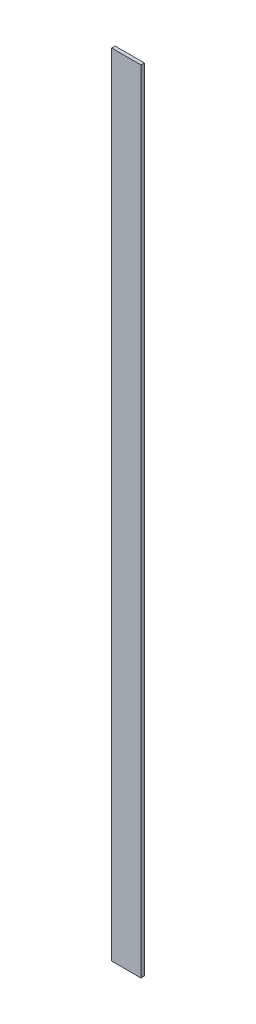
ISO-10303-21;
HEADER;
FILE_DESCRIPTION(('STEP AP214'),'2;1');
FILE_NAME('part.step','',(''),(''),'','','');
FILE_SCHEMA(('AUTOMOTIVE_DESIGN { 1 0 10303 214 1 1 1 1 }'));
ENDSEC;
DATA;
#1=APPLICATION_CONTEXT('core data for automotive mechanical design processes');
#2=APPLICATION_PROTOCOL_DEFINITION('international standard','automotive_design',2000,#1);
#3=PRODUCT_CONTEXT('',#1,'mechanical');
#4=PRODUCT('Part','Part','',(#3));
#5=PRODUCT_RELATED_PRODUCT_CATEGORY('part','',(#4));
#6=PRODUCT_DEFINITION_FORMATION('','',#4);
#7=PRODUCT_DEFINITION_CONTEXT('part definition',#1,'design');
#8=PRODUCT_DEFINITION('design','',#6,#7);
#9=PRODUCT_DEFINITION_SHAPE('','',#8);
#10=(LENGTH_UNIT() NAMED_UNIT(*) SI_UNIT(.MILLI.,.METRE.));
#11=(NAMED_UNIT(*) PLANE_ANGLE_UNIT() SI_UNIT($,.RADIAN.));
#12=(NAMED_UNIT(*) SI_UNIT($,.STERADIAN.) SOLID_ANGLE_UNIT());
#13=UNCERTAINTY_MEASURE_WITH_UNIT(LENGTH_MEASURE(1.E-05),#10,'distance_accuracy_value','');
#14=(GEOMETRIC_REPRESENTATION_CONTEXT(3) GLOBAL_UNCERTAINTY_ASSIGNED_CONTEXT((#13)) GLOBAL_UNIT_ASSIGNED_CONTEXT((#10,
#11,#12)) REPRESENTATION_CONTEXT('',''));
#15=CARTESIAN_POINT('',(0.,0.,0.));
#16=DIRECTION('',(0.,0.,1.));
#17=DIRECTION('',(1.,0.,0.));
#18=AXIS2_PLACEMENT_3D('',#15,#16,#17);
#19=CARTESIAN_POINT('',(-3.79611650485437,15.8033980582524,-1.));
#20=DIRECTION('',(-1.,0.,0.));
#21=DIRECTION('',(0.,-1.,0.));
#22=AXIS2_PLACEMENT_3D('',#19,#20,#21);
#23=PLANE('',#22);
#24=DIRECTION('',(0.,-1.,0.));
#25=VECTOR('',#24,1.);
#26=CARTESIAN_POINT('',(-3.79611650485437,15.8033980582524,0.));
#27=LINE('',#26,#25);
#28=CARTESIAN_POINT('',(-3.79611650485437,15.8033980582524,0.));
#29=VERTEX_POINT('',#28);
#30=CARTESIAN_POINT('',(-3.79611650485434,-214.196601941748,0.));
#31=VERTEX_POINT('',#30);
#32=EDGE_CURVE('E100',#29,#31,#27,.T.);
#33=ORIENTED_EDGE('',*,*,#32,.F.);
#34=DIRECTION('',(0.,0.,1.));
#35=VECTOR('',#34,1.);
#36=CARTESIAN_POINT('',(-3.79611650485437,15.8033980582524,-1.));
#37=LINE('',#36,#35);
#38=CARTESIAN_POINT('',(-3.79611650485437,15.8033980582524,-1.));
#39=VERTEX_POINT('',#38);
#40=EDGE_CURVE('E11',#39,#29,#37,.T.);
#41=ORIENTED_EDGE('',*,*,#40,.F.);
#42=DIRECTION('',(0.,-1.,0.));
#43=VECTOR('',#42,1.);
#44=CARTESIAN_POINT('',(-3.79611650485437,15.8033980582524,-1.));
#45=LINE('',#44,#43);
#46=CARTESIAN_POINT('',(-3.79611650485434,-214.196601941748,-1.));
#47=VERTEX_POINT('',#46);
#48=EDGE_CURVE('E94',#39,#47,#45,.T.);
#49=ORIENTED_EDGE('',*,*,#48,.T.);
#50=DIRECTION('',(0.,0.,1.));
#51=VECTOR('',#50,1.);
#52=CARTESIAN_POINT('',(-3.79611650485434,-214.196601941748,-1.));
#53=LINE('',#52,#51);
#54=EDGE_CURVE('E39',#47,#31,#53,.T.);
#55=ORIENTED_EDGE('',*,*,#54,.T.);
#56=EDGE_LOOP('',(#33,#41,#49,#55));
#57=FACE_BOUND('',#56,.T.);
#58=ADVANCED_FACE('F36',(#57),#23,.T.);
#59=CARTESIAN_POINT('',(-3.79611650485437,15.8033980582524,-1.));
#60=DIRECTION('',(0.,1.,0.));
#61=DIRECTION('',(0.,0.,1.));
#62=AXIS2_PLACEMENT_3D('',#59,#60,#61);
#63=PLANE('',#62);
#64=DIRECTION('',(-1.,0.,0.));
#65=VECTOR('',#64,1.);
#66=CARTESIAN_POINT('',(-3.79611650485437,15.8033980582524,0.));
#67=LINE('',#66,#65);
#68=CARTESIAN_POINT('',(4.70388349514563,15.8033980582524,0.));
#69=VERTEX_POINT('',#68);
#70=EDGE_CURVE('E96',#69,#29,#67,.T.);
#71=ORIENTED_EDGE('',*,*,#70,.F.);
#72=DIRECTION('',(0.,0.,1.));
#73=VECTOR('',#72,1.);
#74=CARTESIAN_POINT('',(4.70388349514563,15.8033980582524,-1.));
#75=LINE('',#74,#73);
#76=CARTESIAN_POINT('',(4.70388349514563,15.8033980582524,-1.));
#77=VERTEX_POINT('',#76);
#78=EDGE_CURVE('E45',#77,#69,#75,.T.);
#79=ORIENTED_EDGE('',*,*,#78,.F.);
#80=DIRECTION('',(-1.,0.,0.));
#81=VECTOR('',#80,1.);
#82=CARTESIAN_POINT('',(-3.79611650485437,15.8033980582524,-1.));
#83=LINE('',#82,#81);
#84=EDGE_CURVE('E91',#77,#39,#83,.T.);
#85=ORIENTED_EDGE('',*,*,#84,.T.);
#86=ORIENTED_EDGE('',*,*,#40,.T.);
#87=EDGE_LOOP('',(#71,#79,#85,#86));
#88=FACE_BOUND('',#87,.T.);
#89=ADVANCED_FACE('F110',(#88),#63,.T.);
#90=CARTESIAN_POINT('',(4.70388349514563,15.8033980582524,-1.));
#91=DIRECTION('',(1.,0.,0.));
#92=DIRECTION('',(0.,1.,0.));
#93=AXIS2_PLACEMENT_3D('',#90,#91,#92);
#94=PLANE('',#93);
#95=DIRECTION('',(0.,1.,0.));
#96=VECTOR('',#95,1.);
#97=CARTESIAN_POINT('',(4.70388349514563,15.8033980582524,0.));
#98=LINE('',#97,#96);
#99=CARTESIAN_POINT('',(4.70388349514566,-214.196601941748,0.));
#100=VERTEX_POINT('',#99);
#101=EDGE_CURVE('E86',#100,#69,#98,.T.);
#102=ORIENTED_EDGE('',*,*,#101,.F.);
#103=DIRECTION('',(0.,0.,1.));
#104=VECTOR('',#103,1.);
#105=CARTESIAN_POINT('',(4.70388349514566,-214.196601941748,-1.));
#106=LINE('',#105,#104);
#107=CARTESIAN_POINT('',(4.70388349514566,-214.196601941748,-1.));
#108=VERTEX_POINT('',#107);
#109=EDGE_CURVE('E81',#108,#100,#106,.T.);
#110=ORIENTED_EDGE('',*,*,#109,.F.);
#111=DIRECTION('',(0.,1.,0.));
#112=VECTOR('',#111,1.);
#113=CARTESIAN_POINT('',(4.70388349514563,15.8033980582524,-1.));
#114=LINE('',#113,#112);
#115=EDGE_CURVE('E84',#108,#77,#114,.T.);
#116=ORIENTED_EDGE('',*,*,#115,.T.);
#117=ORIENTED_EDGE('',*,*,#78,.T.);
#118=EDGE_LOOP('',(#102,#110,#116,#117));
#119=FACE_BOUND('',#118,.T.);
#120=ADVANCED_FACE('F83',(#119),#94,.T.);
#121=CARTESIAN_POINT('',(-3.79611650485434,-214.196601941748,-1.));
#122=DIRECTION('',(0.,-1.,0.));
#123=DIRECTION('',(0.,0.,-1.));
#124=AXIS2_PLACEMENT_3D('',#121,#122,#123);
#125=PLANE('',#124);
#126=DIRECTION('',(1.,0.,0.));
#127=VECTOR('',#126,1.);
#128=CARTESIAN_POINT('',(-3.79611650485434,-214.196601941748,0.));
#129=LINE('',#128,#127);
#130=EDGE_CURVE('E103',#31,#100,#129,.T.);
#131=ORIENTED_EDGE('',*,*,#130,.F.);
#132=ORIENTED_EDGE('',*,*,#54,.F.);
#133=DIRECTION('',(1.,0.,0.));
#134=VECTOR('',#133,1.);
#135=CARTESIAN_POINT('',(-3.79611650485434,-214.196601941748,-1.));
#136=LINE('',#135,#134);
#137=EDGE_CURVE('E90',#47,#108,#136,.T.);
#138=ORIENTED_EDGE('',*,*,#137,.T.);
#139=ORIENTED_EDGE('',*,*,#109,.T.);
#140=EDGE_LOOP('',(#131,#132,#138,#139));
#141=FACE_BOUND('',#140,.T.);
#142=ADVANCED_FACE('F93',(#141),#125,.T.);
#143=CARTESIAN_POINT('',(0.,0.,-1.));
#144=DIRECTION('',(0.,0.,1.));
#145=DIRECTION('',(1.,0.,0.));
#146=AXIS2_PLACEMENT_3D('',#143,#144,#145);
#147=PLANE('',#146);
#148=ORIENTED_EDGE('',*,*,#48,.F.);
#149=ORIENTED_EDGE('',*,*,#84,.F.);
#150=ORIENTED_EDGE('',*,*,#115,.F.);
#151=ORIENTED_EDGE('',*,*,#137,.F.);
#152=EDGE_LOOP('',(#148,#149,#150,#151));
#153=FACE_BOUND('',#152,.T.);
#154=ADVANCED_FACE('F89',(#153),#147,.F.);
#155=CARTESIAN_POINT('',(0.,0.,0.));
#156=DIRECTION('',(0.,0.,1.));
#157=DIRECTION('',(1.,0.,0.));
#158=AXIS2_PLACEMENT_3D('',#155,#156,#157);
#159=PLANE('',#158);
#160=ORIENTED_EDGE('',*,*,#32,.T.);
#161=ORIENTED_EDGE('',*,*,#130,.T.);
#162=ORIENTED_EDGE('',*,*,#101,.T.);
#163=ORIENTED_EDGE('',*,*,#70,.T.);
#164=EDGE_LOOP('',(#160,#161,#162,#163));
#165=FACE_BOUND('',#164,.T.);
#166=ADVANCED_FACE('F109',(#165),#159,.T.);
#167=CLOSED_SHELL('',(#58,#89,#120,#142,#154,#166));
#168=MANIFOLD_SOLID_BREP('B2',#167);
#169=ADVANCED_BREP_SHAPE_REPRESENTATION('',(#18,#168),#14);
#170=SHAPE_DEFINITION_REPRESENTATION(#9,#169);
ENDSEC;
END-ISO-10303-21;
